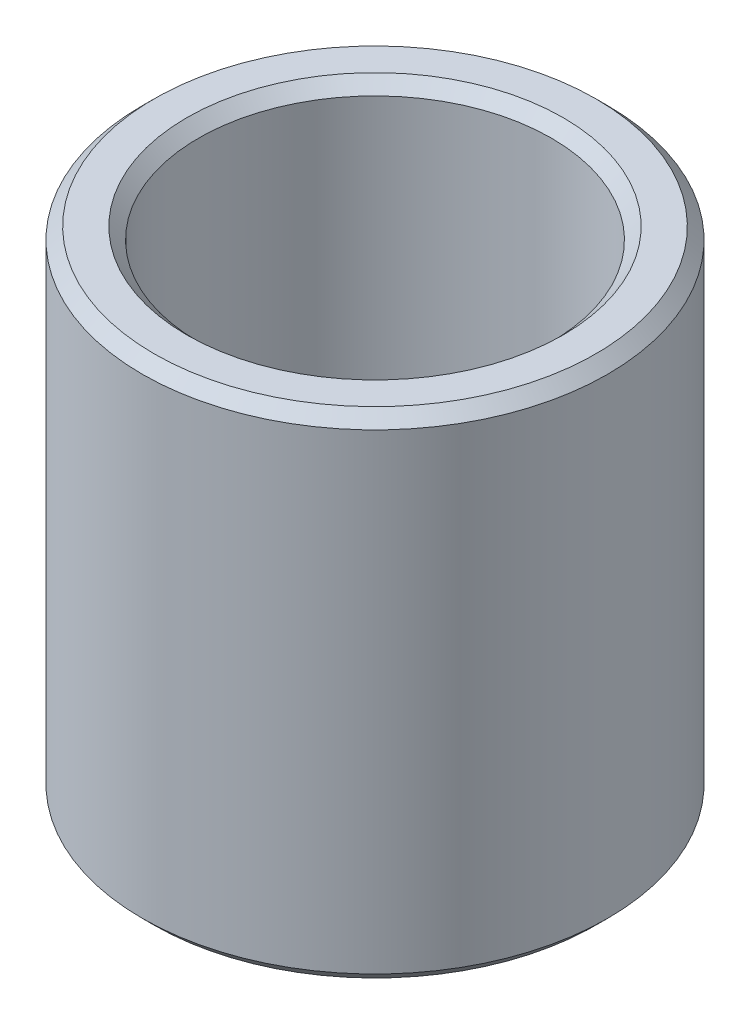
ISO-10303-21;
HEADER;
FILE_DESCRIPTION(('STEP AP214'),'2;1');
FILE_NAME('part.step','',(''),(''),'','','');
FILE_SCHEMA(('AUTOMOTIVE_DESIGN { 1 0 10303 214 1 1 1 1 }'));
ENDSEC;
DATA;
#1=APPLICATION_CONTEXT('core data for automotive mechanical design processes');
#2=APPLICATION_PROTOCOL_DEFINITION('international standard','automotive_design',2000,#1);
#3=PRODUCT_CONTEXT('',#1,'mechanical');
#4=PRODUCT('Part','Part','',(#3));
#5=PRODUCT_RELATED_PRODUCT_CATEGORY('part','',(#4));
#6=PRODUCT_DEFINITION_FORMATION('','',#4);
#7=PRODUCT_DEFINITION_CONTEXT('part definition',#1,'design');
#8=PRODUCT_DEFINITION('design','',#6,#7);
#9=PRODUCT_DEFINITION_SHAPE('','',#8);
#10=(LENGTH_UNIT() NAMED_UNIT(*) SI_UNIT(.MILLI.,.METRE.));
#11=(NAMED_UNIT(*) PLANE_ANGLE_UNIT() SI_UNIT($,.RADIAN.));
#12=(NAMED_UNIT(*) SI_UNIT($,.STERADIAN.) SOLID_ANGLE_UNIT());
#13=UNCERTAINTY_MEASURE_WITH_UNIT(LENGTH_MEASURE(1.E-05),#10,'distance_accuracy_value','');
#14=(GEOMETRIC_REPRESENTATION_CONTEXT(3) GLOBAL_UNCERTAINTY_ASSIGNED_CONTEXT((#13)) GLOBAL_UNIT_ASSIGNED_CONTEXT((#10,
#11,#12)) REPRESENTATION_CONTEXT('',''));
#15=CARTESIAN_POINT('',(0.,0.,0.));
#16=DIRECTION('',(0.,0.,1.));
#17=DIRECTION('',(1.,0.,0.));
#18=AXIS2_PLACEMENT_3D('',#15,#16,#17);
#19=CARTESIAN_POINT('',(0.,79.7517120552772,0.));
#20=DIRECTION('',(0.,-1.,0.));
#21=DIRECTION('',(0.,0.,-1.));
#22=AXIS2_PLACEMENT_3D('',#19,#20,#21);
#23=CYLINDRICAL_SURFACE('',#22,37.5);
#24=CARTESIAN_POINT('',(0.,1.90170329671815,0.));
#25=DIRECTION('',(0.,1.,0.));
#26=DIRECTION('',(0.,0.,1.));
#27=AXIS2_PLACEMENT_3D('',#24,#25,#26);
#28=CIRCLE('',#27,37.5);
#29=CARTESIAN_POINT('',(0.,1.90170329671814,-37.5));
#30=VERTEX_POINT('',#29);
#31=EDGE_CURVE('E10',#30,#30,#28,.T.);
#32=CARTESIAN_POINT('',(0.,77.8500087585591,0.));
#33=DIRECTION('',(0.,1.,0.));
#34=DIRECTION('',(0.,0.,1.));
#35=AXIS2_PLACEMENT_3D('',#32,#33,#34);
#36=CIRCLE('',#35,37.5);
#37=CARTESIAN_POINT('',(0.,77.8500087585591,-37.5));
#38=VERTEX_POINT('',#37);
#39=EDGE_CURVE('E50',#38,#38,#36,.F.);
#40=CARTESIAN_POINT('',(0.,1.90170329671814,-37.5));
#41=CARTESIAN_POINT('',(0.,2.69283147861232,-37.5));
#42=CARTESIAN_POINT('',(0.,3.4839596605065,-37.5));
#43=CARTESIAN_POINT('',(0.,5.06621602429485,-37.5));
#44=CARTESIAN_POINT('',(0.,5.85734420618903,-37.5));
#45=CARTESIAN_POINT('',(0.,7.43960056997738,-37.5));
#46=CARTESIAN_POINT('',(0.,8.23072875187156,-37.5));
#47=CARTESIAN_POINT('',(0.,9.81298511565991,-37.5));
#48=CARTESIAN_POINT('',(0.,10.6041132975541,-37.5));
#49=CARTESIAN_POINT('',(0.,12.1863696613424,-37.5));
#50=CARTESIAN_POINT('',(0.,12.9774978432366,-37.5));
#51=CARTESIAN_POINT('',(0.,14.559754207025,-37.5));
#52=CARTESIAN_POINT('',(0.,15.3508823889191,-37.5));
#53=CARTESIAN_POINT('',(0.,16.9331387527075,-37.5));
#54=CARTESIAN_POINT('',(0.,17.7242669346017,-37.5));
#55=CARTESIAN_POINT('',(0.,19.30652329839,-37.5));
#56=CARTESIAN_POINT('',(0.,20.0976514802842,-37.5));
#57=CARTESIAN_POINT('',(0.,21.6799078440726,-37.5));
#58=CARTESIAN_POINT('',(0.,22.4710360259667,-37.5));
#59=CARTESIAN_POINT('',(0.,24.0532923897551,-37.5));
#60=CARTESIAN_POINT('',(0.,24.8444205716493,-37.5));
#61=CARTESIAN_POINT('',(0.,26.4266769354376,-37.5));
#62=CARTESIAN_POINT('',(0.,27.2178051173318,-37.5));
#63=CARTESIAN_POINT('',(0.,28.8000614811201,-37.5));
#64=CARTESIAN_POINT('',(0.,29.5911896630143,-37.5));
#65=CARTESIAN_POINT('',(0.,31.1734460268027,-37.5));
#66=CARTESIAN_POINT('',(0.,31.9645742086969,-37.5));
#67=CARTESIAN_POINT('',(0.,33.5468305724852,-37.5));
#68=CARTESIAN_POINT('',(0.,34.3379587543794,-37.5));
#69=CARTESIAN_POINT('',(0.,35.9202151181677,-37.5));
#70=CARTESIAN_POINT('',(0.,36.7113433000619,-37.5));
#71=CARTESIAN_POINT('',(0.,38.2935996638503,-37.5));
#72=CARTESIAN_POINT('',(0.,39.0847278457445,-37.5));
#73=CARTESIAN_POINT('',(0.,40.6669842095328,-37.5));
#74=CARTESIAN_POINT('',(0.,41.458112391427,-37.5));
#75=CARTESIAN_POINT('',(0.,43.0403687552153,-37.5));
#76=CARTESIAN_POINT('',(0.,43.8314969371095,-37.5));
#77=CARTESIAN_POINT('',(0.,45.4137533008979,-37.5));
#78=CARTESIAN_POINT('',(0.,46.204881482792,-37.5));
#79=CARTESIAN_POINT('',(0.,47.7871378465804,-37.5));
#80=CARTESIAN_POINT('',(0.,48.5782660284746,-37.5));
#81=CARTESIAN_POINT('',(0.,50.1605223922629,-37.5));
#82=CARTESIAN_POINT('',(0.,50.9516505741571,-37.5));
#83=CARTESIAN_POINT('',(0.,52.5339069379455,-37.5));
#84=CARTESIAN_POINT('',(0.,53.3250351198396,-37.5));
#85=CARTESIAN_POINT('',(0.,54.907291483628,-37.5));
#86=CARTESIAN_POINT('',(0.,55.6984196655222,-37.5));
#87=CARTESIAN_POINT('',(0.,57.2806760293105,-37.5));
#88=CARTESIAN_POINT('',(0.,58.0718042112047,-37.5));
#89=CARTESIAN_POINT('',(0.,59.654060574993,-37.5));
#90=CARTESIAN_POINT('',(0.,60.4451887568872,-37.5));
#91=CARTESIAN_POINT('',(0.,62.0274451206756,-37.5));
#92=CARTESIAN_POINT('',(0.,62.8185733025698,-37.5));
#93=CARTESIAN_POINT('',(0.,64.4008296663581,-37.5));
#94=CARTESIAN_POINT('',(0.,65.1919578482523,-37.5));
#95=CARTESIAN_POINT('',(0.,66.7742142120406,-37.5));
#96=CARTESIAN_POINT('',(0.,67.5653423939348,-37.5));
#97=CARTESIAN_POINT('',(0.,69.1475987577232,-37.5));
#98=CARTESIAN_POINT('',(0.,69.9387269396174,-37.5));
#99=CARTESIAN_POINT('',(0.,71.5209833034057,-37.5));
#100=CARTESIAN_POINT('',(0.,72.3121114852999,-37.5));
#101=CARTESIAN_POINT('',(0.,73.8943678490882,-37.5));
#102=CARTESIAN_POINT('',(0.,74.6854960309824,-37.5));
#103=CARTESIAN_POINT('',(0.,76.2677523947708,-37.5));
#104=CARTESIAN_POINT('',(0.,77.0588805766649,-37.5));
#105=CARTESIAN_POINT('',(0.,77.8500087585591,-37.5));
#106=B_SPLINE_CURVE_WITH_KNOTS('',3,(#40,#41,#42,#43,#44,#45,#46,#47,#48,#49,#50,#51,#52,#53,
#54,#55,#56,#57,#58,#59,#60,#61,#62,#63,#64,#65,#66,#67,#68,#69,#70,#71,#72,#73,#74,#75,#76,#77,
#78,#79,#80,#81,#82,#83,#84,#85,#86,#87,#88,#89,#90,#91,#92,#93,#94,#95,#96,#97,#98,#99,#100,
#101,#102,#103,#104,#105),.UNSPECIFIED.,.F.,.F.,(4,2,2,2,2,2,2,2,2,2,2,2,2,2,2,2,2,2,2,2,2,2,2,
2,2,2,2,2,2,2,2,2,4),(0.,2.37338454568253,4.74676909136507,7.1201536370476,9.49353818273012,
11.8669227284127,14.2403072740952,16.6136918197777,18.9870763654602,21.3604609111428,
23.7338454568253,26.1072300025078,28.4806145481904,30.8539990938729,33.2273836395554,
35.600768185238,37.9741527309205,40.347537276603,42.7209218222855,45.0943063679681,
47.4676909136506,49.8410754593331,52.2144600050157,54.5878445506982,56.9612290963807,
59.3346136420633,61.7079981877458,64.0813827334283,66.4547672791109,68.8281518247934,
71.2015363704759,73.5749209161584,75.948305461841),.UNSPECIFIED.);
#107=EDGE_CURVE('BSEAM39',#30,#38,#106,.T.);
#108=ORIENTED_EDGE('',*,*,#31,.T.);
#109=ORIENTED_EDGE('',*,*,#39,.T.);
#110=ORIENTED_EDGE('',*,*,#107,.T.);
#111=ORIENTED_EDGE('',*,*,#107,.F.);
#112=EDGE_LOOP('',(#108,#110,#109,#111));
#113=FACE_BOUND('',#112,.T.);
#114=ADVANCED_FACE('F39',(#113),#23,.T.);
#115=CARTESIAN_POINT('',(0.,79.7517120552772,0.));
#116=DIRECTION('',(0.,1.,0.));
#117=DIRECTION('',(0.,0.,1.));
#118=AXIS2_PLACEMENT_3D('',#115,#116,#117);
#119=PLANE('',#118);
#120=CARTESIAN_POINT('',(0.,79.7517120552772,0.));
#121=DIRECTION('',(0.,1.,0.));
#122=DIRECTION('',(0.,0.,1.));
#123=AXIS2_PLACEMENT_3D('',#120,#121,#122);
#124=CIRCLE('',#123,30.3340323940022);
#125=CARTESIAN_POINT('',(0.,79.7517120552772,30.3340323940022));
#126=VERTEX_POINT('',#125);
#127=EDGE_CURVE('E58',#126,#126,#124,.F.);
#128=ORIENTED_EDGE('',*,*,#127,.T.);
#129=EDGE_LOOP('',(#128));
#130=FACE_BOUND('',#129,.T.);
#131=CARTESIAN_POINT('',(0.,79.7517120552772,0.));
#132=DIRECTION('',(0.,1.,0.));
#133=DIRECTION('',(0.,0.,1.));
#134=AXIS2_PLACEMENT_3D('',#131,#132,#133);
#135=CIRCLE('',#134,35.598296703282);
#136=CARTESIAN_POINT('',(0.,79.7517120552772,35.598296703282));
#137=VERTEX_POINT('',#136);
#138=EDGE_CURVE('E61',#137,#137,#135,.T.);
#139=ORIENTED_EDGE('',*,*,#138,.T.);
#140=EDGE_LOOP('',(#139));
#141=FACE_BOUND('',#140,.T.);
#142=ADVANCED_FACE('F88',(#130,#141),#119,.T.);
#143=CARTESIAN_POINT('',(0.,0.,0.));
#144=DIRECTION('',(0.,1.,0.));
#145=DIRECTION('',(0.,0.,1.));
#146=AXIS2_PLACEMENT_3D('',#143,#144,#145);
#147=PLANE('',#146);
#148=CARTESIAN_POINT('',(0.,0.,0.));
#149=DIRECTION('',(0.,1.,0.));
#150=DIRECTION('',(0.,0.,1.));
#151=AXIS2_PLACEMENT_3D('',#148,#149,#150);
#152=CIRCLE('',#151,30.3340323940022);
#153=CARTESIAN_POINT('',(0.,0.,30.3340323940022));
#154=VERTEX_POINT('',#153);
#155=EDGE_CURVE('E51',#154,#154,#152,.T.);
#156=ORIENTED_EDGE('',*,*,#155,.T.);
#157=EDGE_LOOP('',(#156));
#158=FACE_BOUND('',#157,.T.);
#159=CARTESIAN_POINT('',(0.,0.,0.));
#160=DIRECTION('',(0.,1.,0.));
#161=DIRECTION('',(0.,0.,1.));
#162=AXIS2_PLACEMENT_3D('',#159,#160,#161);
#163=CIRCLE('',#162,35.5982967032818);
#164=CARTESIAN_POINT('',(0.,0.,35.5982967032818));
#165=VERTEX_POINT('',#164);
#166=EDGE_CURVE('E54',#165,#165,#163,.F.);
#167=ORIENTED_EDGE('',*,*,#166,.T.);
#168=EDGE_LOOP('',(#167));
#169=FACE_BOUND('',#168,.T.);
#170=ADVANCED_FACE('F83',(#158,#169),#147,.F.);
#171=CARTESIAN_POINT('',(0.,79.7517120552772,0.));
#172=DIRECTION('',(0.,-1.,0.));
#173=DIRECTION('',(0.,0.,-1.));
#174=AXIS2_PLACEMENT_3D('',#171,#172,#173);
#175=CYLINDRICAL_SURFACE('',#174,28.4323290972841);
#176=CARTESIAN_POINT('',(0.,77.850008758559,0.));
#177=DIRECTION('',(0.,1.,0.));
#178=DIRECTION('',(0.,0.,1.));
#179=AXIS2_PLACEMENT_3D('',#176,#177,#178);
#180=CIRCLE('',#179,28.4323290972841);
#181=CARTESIAN_POINT('',(0.,77.850008758559,-28.4323290972841));
#182=VERTEX_POINT('',#181);
#183=EDGE_CURVE('E67',#182,#182,#180,.T.);
#184=CARTESIAN_POINT('',(0.,1.90170329671807,0.));
#185=DIRECTION('',(0.,1.,0.));
#186=DIRECTION('',(0.,0.,1.));
#187=AXIS2_PLACEMENT_3D('',#184,#185,#186);
#188=CIRCLE('',#187,28.4323290972841);
#189=CARTESIAN_POINT('',(0.,1.90170329671806,-28.4323290972841));
#190=VERTEX_POINT('',#189);
#191=EDGE_CURVE('E69',#190,#190,#188,.F.);
#192=CARTESIAN_POINT('',(0.,77.850008758559,-28.4323290972841));
#193=CARTESIAN_POINT('',(0.,77.0588805766648,-28.4323290972841));
#194=CARTESIAN_POINT('',(0.,76.2677523947707,-28.4323290972841));
#195=CARTESIAN_POINT('',(0.,74.6854960309823,-28.4323290972841));
#196=CARTESIAN_POINT('',(0.,73.8943678490881,-28.4323290972841));
#197=CARTESIAN_POINT('',(0.,72.3121114852998,-28.4323290972841));
#198=CARTESIAN_POINT('',(0.,71.5209833034056,-28.4323290972841));
#199=CARTESIAN_POINT('',(0.,69.9387269396172,-28.4323290972841));
#200=CARTESIAN_POINT('',(0.,69.1475987577231,-28.4323290972841));
#201=CARTESIAN_POINT('',(0.,67.5653423939347,-28.4323290972841));
#202=CARTESIAN_POINT('',(0.,66.7742142120405,-28.4323290972841));
#203=CARTESIAN_POINT('',(0.,65.1919578482522,-28.4323290972841));
#204=CARTESIAN_POINT('',(0.,64.400829666358,-28.4323290972841));
#205=CARTESIAN_POINT('',(0.,62.8185733025697,-28.4323290972841));
#206=CARTESIAN_POINT('',(0.,62.0274451206755,-28.4323290972841));
#207=CARTESIAN_POINT('',(0.,60.4451887568871,-28.4323290972841));
#208=CARTESIAN_POINT('',(0.,59.654060574993,-28.4323290972841));
#209=CARTESIAN_POINT('',(0.,58.0718042112046,-28.4323290972841));
#210=CARTESIAN_POINT('',(0.,57.2806760293104,-28.4323290972841));
#211=CARTESIAN_POINT('',(0.,55.6984196655221,-28.4323290972841));
#212=CARTESIAN_POINT('',(0.,54.9072914836279,-28.4323290972841));
#213=CARTESIAN_POINT('',(0.,53.3250351198395,-28.4323290972841));
#214=CARTESIAN_POINT('',(0.,52.5339069379454,-28.4323290972841));
#215=CARTESIAN_POINT('',(0.,50.951650574157,-28.4323290972841));
#216=CARTESIAN_POINT('',(0.,50.1605223922628,-28.4323290972841));
#217=CARTESIAN_POINT('',(0.,48.5782660284745,-28.4323290972841));
#218=CARTESIAN_POINT('',(0.,47.7871378465803,-28.4323290972841));
#219=CARTESIAN_POINT('',(0.,46.2048814827919,-28.4323290972841));
#220=CARTESIAN_POINT('',(0.,45.4137533008978,-28.4323290972841));
#221=CARTESIAN_POINT('',(0.,43.8314969371094,-28.4323290972841));
#222=CARTESIAN_POINT('',(0.,43.0403687552152,-28.4323290972841));
#223=CARTESIAN_POINT('',(0.,41.4581123914269,-28.4323290972841));
#224=CARTESIAN_POINT('',(0.,40.6669842095327,-28.4323290972841));
#225=CARTESIAN_POINT('',(0.,39.0847278457444,-28.4323290972841));
#226=CARTESIAN_POINT('',(0.,38.2935996638502,-28.4323290972841));
#227=CARTESIAN_POINT('',(0.,36.7113433000618,-28.4323290972841));
#228=CARTESIAN_POINT('',(0.,35.9202151181677,-28.4323290972841));
#229=CARTESIAN_POINT('',(0.,34.3379587543793,-28.4323290972841));
#230=CARTESIAN_POINT('',(0.,33.5468305724851,-28.4323290972841));
#231=CARTESIAN_POINT('',(0.,31.9645742086968,-28.4323290972841));
#232=CARTESIAN_POINT('',(0.,31.1734460268026,-28.4323290972841));
#233=CARTESIAN_POINT('',(0.,29.5911896630142,-28.4323290972841));
#234=CARTESIAN_POINT('',(0.,28.8000614811201,-28.4323290972841));
#235=CARTESIAN_POINT('',(0.,27.2178051173317,-28.4323290972841));
#236=CARTESIAN_POINT('',(0.,26.4266769354375,-28.4323290972841));
#237=CARTESIAN_POINT('',(0.,24.8444205716492,-28.4323290972841));
#238=CARTESIAN_POINT('',(0.,24.053292389755,-28.4323290972841));
#239=CARTESIAN_POINT('',(0.,22.4710360259666,-28.4323290972841));
#240=CARTESIAN_POINT('',(0.,21.6799078440725,-28.4323290972841));
#241=CARTESIAN_POINT('',(0.,20.0976514802841,-28.4323290972841));
#242=CARTESIAN_POINT('',(0.,19.3065232983899,-28.4323290972841));
#243=CARTESIAN_POINT('',(0.,17.7242669346016,-28.4323290972841));
#244=CARTESIAN_POINT('',(0.,16.9331387527074,-28.4323290972841));
#245=CARTESIAN_POINT('',(0.,15.3508823889191,-28.4323290972841));
#246=CARTESIAN_POINT('',(0.,14.5597542070249,-28.4323290972841));
#247=CARTESIAN_POINT('',(0.,12.9774978432365,-28.4323290972841));
#248=CARTESIAN_POINT('',(0.,12.1863696613424,-28.4323290972841));
#249=CARTESIAN_POINT('',(0.,10.604113297554,-28.4323290972841));
#250=CARTESIAN_POINT('',(0.,9.81298511565982,-28.4323290972841));
#251=CARTESIAN_POINT('',(0.,8.23072875187147,-28.4323290972841));
#252=CARTESIAN_POINT('',(0.,7.4396005699773,-28.4323290972841));
#253=CARTESIAN_POINT('',(0.,5.85734420618895,-28.4323290972841));
#254=CARTESIAN_POINT('',(0.,5.06621602429477,-28.4323290972841));
#255=CARTESIAN_POINT('',(0.,3.48395966050641,-28.4323290972841));
#256=CARTESIAN_POINT('',(0.,2.69283147861224,-28.4323290972841));
#257=CARTESIAN_POINT('',(0.,1.90170329671806,-28.4323290972841));
#258=B_SPLINE_CURVE_WITH_KNOTS('',3,(#192,#193,#194,#195,#196,#197,#198,#199,#200,#201,#202,
#203,#204,#205,#206,#207,#208,#209,#210,#211,#212,#213,#214,#215,#216,#217,#218,#219,#220,#221,
#222,#223,#224,#225,#226,#227,#228,#229,#230,#231,#232,#233,#234,#235,#236,#237,#238,#239,#240,
#241,#242,#243,#244,#245,#246,#247,#248,#249,#250,#251,#252,#253,#254,#255,#256,#257),
.UNSPECIFIED.,.F.,.F.,(4,2,2,2,2,2,2,2,2,2,2,2,2,2,2,2,2,2,2,2,2,2,2,2,2,2,2,2,2,2,2,2,4),(0.,
2.37338454568252,4.74676909136505,7.12015363704759,9.49353818273012,11.8669227284126,
14.2403072740952,16.6136918197777,18.9870763654602,21.3604609111428,23.7338454568253,
26.1072300025078,28.4806145481904,30.8539990938729,33.2273836395554,35.6007681852379,
37.9741527309205,40.347537276603,42.7209218222855,45.0943063679681,47.4676909136506,
49.8410754593331,52.2144600050156,54.5878445506982,56.9612290963807,59.3346136420632,
61.7079981877458,64.0813827334283,66.4547672791108,68.8281518247934,71.2015363704759,
73.5749209161584,75.9483054618409),.UNSPECIFIED.);
#259=EDGE_CURVE('BSEAM71',#182,#190,#258,.T.);
#260=ORIENTED_EDGE('',*,*,#183,.T.);
#261=ORIENTED_EDGE('',*,*,#191,.T.);
#262=ORIENTED_EDGE('',*,*,#259,.T.);
#263=ORIENTED_EDGE('',*,*,#259,.F.);
#264=EDGE_LOOP('',(#260,#262,#261,#263));
#265=FACE_BOUND('',#264,.T.);
#266=ADVANCED_FACE('F71',(#265),#175,.F.);
#267=CARTESIAN_POINT('',(0.,77.850008758559,0.));
#268=DIRECTION('',(0.,1.,0.));
#269=DIRECTION('',(0.,0.,1.));
#270=AXIS2_PLACEMENT_3D('',#267,#268,#269);
#271=CONICAL_SURFACE('',#270,28.4323290972841,0.785398163397448);
#272=ORIENTED_EDGE('',*,*,#127,.F.);
#273=EDGE_LOOP('',(#272));
#274=FACE_BOUND('',#273,.T.);
#275=ORIENTED_EDGE('',*,*,#183,.F.);
#276=EDGE_LOOP('',(#275));
#277=FACE_BOUND('',#276,.T.);
#278=ADVANCED_FACE('F77',(#274,#277),#271,.F.);
#279=CARTESIAN_POINT('',(0.,0.,0.));
#280=DIRECTION('',(0.,-1.,0.));
#281=DIRECTION('',(0.,0.,-1.));
#282=AXIS2_PLACEMENT_3D('',#279,#280,#281);
#283=CONICAL_SURFACE('',#282,30.3340323940022,0.785398163397445);
#284=ORIENTED_EDGE('',*,*,#191,.F.);
#285=EDGE_LOOP('',(#284));
#286=FACE_BOUND('',#285,.T.);
#287=ORIENTED_EDGE('',*,*,#155,.F.);
#288=EDGE_LOOP('',(#287));
#289=FACE_BOUND('',#288,.T.);
#290=ADVANCED_FACE('F73',(#286,#289),#283,.F.);
#291=CARTESIAN_POINT('',(0.,1.90170329671815,0.));
#292=DIRECTION('',(0.,1.,0.));
#293=DIRECTION('',(0.,0.,1.));
#294=AXIS2_PLACEMENT_3D('',#291,#292,#293);
#295=CONICAL_SURFACE('',#294,37.5,0.785398163397452);
#296=ORIENTED_EDGE('',*,*,#166,.F.);
#297=EDGE_LOOP('',(#296));
#298=FACE_BOUND('',#297,.T.);
#299=ORIENTED_EDGE('',*,*,#31,.F.);
#300=EDGE_LOOP('',(#299));
#301=FACE_BOUND('',#300,.T.);
#302=ADVANCED_FACE('F76',(#298,#301),#295,.T.);
#303=CARTESIAN_POINT('',(0.,79.7517120552772,0.));
#304=DIRECTION('',(0.,-1.,0.));
#305=DIRECTION('',(0.,0.,-1.));
#306=AXIS2_PLACEMENT_3D('',#303,#304,#305);
#307=CONICAL_SURFACE('',#306,35.598296703282,0.78539816339745);
#308=ORIENTED_EDGE('',*,*,#39,.F.);
#309=EDGE_LOOP('',(#308));
#310=FACE_BOUND('',#309,.T.);
#311=ORIENTED_EDGE('',*,*,#138,.F.);
#312=EDGE_LOOP('',(#311));
#313=FACE_BOUND('',#312,.T.);
#314=ADVANCED_FACE('F45',(#310,#313),#307,.T.);
#315=CLOSED_SHELL('',(#114,#142,#170,#266,#278,#290,#302,#314));
#316=MANIFOLD_SOLID_BREP('B2',#315);
#317=ADVANCED_BREP_SHAPE_REPRESENTATION('',(#18,#316),#14);
#318=SHAPE_DEFINITION_REPRESENTATION(#9,#317);
ENDSEC;
END-ISO-10303-21;
